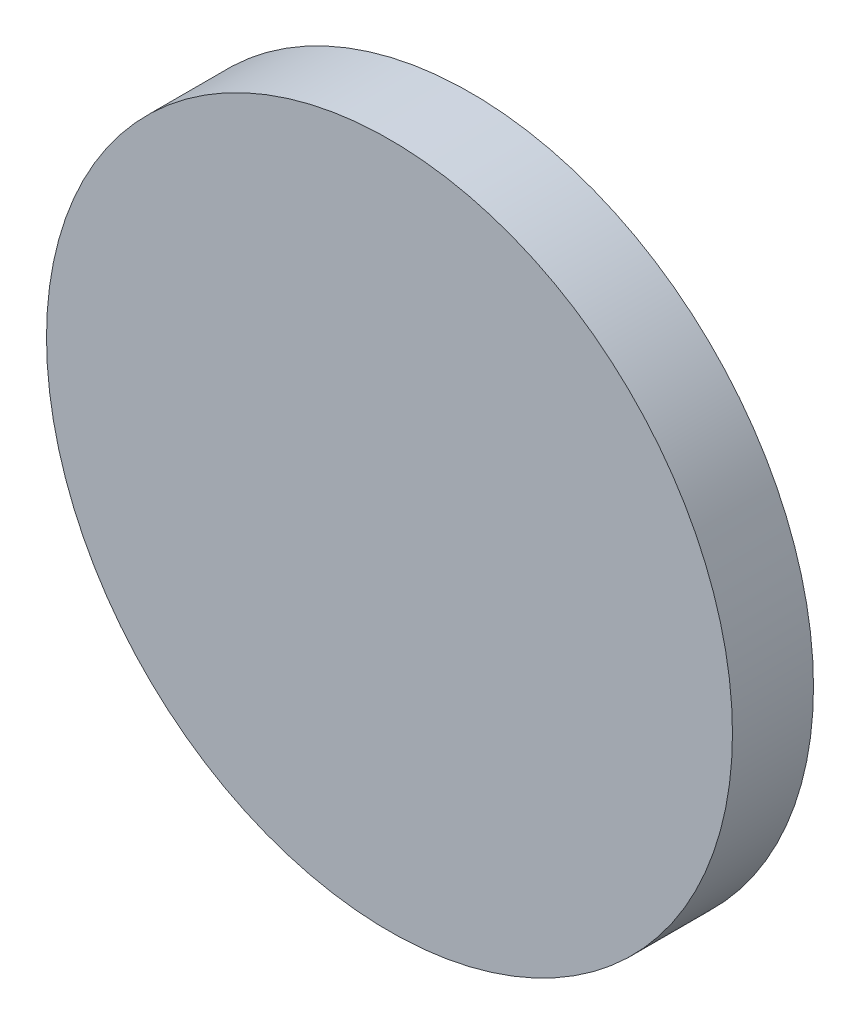
ISO-10303-21;
HEADER;
FILE_DESCRIPTION(('STEP AP214'),'2;1');
FILE_NAME('part.step','',(''),(''),'','','');
FILE_SCHEMA(('AUTOMOTIVE_DESIGN { 1 0 10303 214 1 1 1 1 }'));
ENDSEC;
DATA;
#1=APPLICATION_CONTEXT('core data for automotive mechanical design processes');
#2=APPLICATION_PROTOCOL_DEFINITION('international standard','automotive_design',2000,#1);
#3=PRODUCT_CONTEXT('',#1,'mechanical');
#4=PRODUCT('Part','Part','',(#3));
#5=PRODUCT_RELATED_PRODUCT_CATEGORY('part','',(#4));
#6=PRODUCT_DEFINITION_FORMATION('','',#4);
#7=PRODUCT_DEFINITION_CONTEXT('part definition',#1,'design');
#8=PRODUCT_DEFINITION('design','',#6,#7);
#9=PRODUCT_DEFINITION_SHAPE('','',#8);
#10=(LENGTH_UNIT() NAMED_UNIT(*) SI_UNIT(.MILLI.,.METRE.));
#11=(NAMED_UNIT(*) PLANE_ANGLE_UNIT() SI_UNIT($,.RADIAN.));
#12=(NAMED_UNIT(*) SI_UNIT($,.STERADIAN.) SOLID_ANGLE_UNIT());
#13=UNCERTAINTY_MEASURE_WITH_UNIT(LENGTH_MEASURE(1.E-05),#10,'distance_accuracy_value','');
#14=(GEOMETRIC_REPRESENTATION_CONTEXT(3) GLOBAL_UNCERTAINTY_ASSIGNED_CONTEXT((#13)) GLOBAL_UNIT_ASSIGNED_CONTEXT((#10,
#11,#12)) REPRESENTATION_CONTEXT('',''));
#15=CARTESIAN_POINT('',(0.,0.,0.));
#16=DIRECTION('',(0.,0.,1.));
#17=DIRECTION('',(1.,0.,0.));
#18=AXIS2_PLACEMENT_3D('',#15,#16,#17);
#19=CARTESIAN_POINT('',(0.,0.,3.));
#20=DIRECTION('',(0.,0.,-1.));
#21=DIRECTION('',(-1.,0.,0.));
#22=AXIS2_PLACEMENT_3D('',#19,#20,#21);
#23=CYLINDRICAL_SURFACE('',#22,12.7);
#24=CARTESIAN_POINT('',(0.,0.,3.));
#25=DIRECTION('',(0.,0.,1.));
#26=DIRECTION('',(1.,0.,0.));
#27=AXIS2_PLACEMENT_3D('',#24,#25,#26);
#28=CIRCLE('',#27,12.7);
#29=CARTESIAN_POINT('',(12.7,0.,3.));
#30=VERTEX_POINT('',#29);
#31=EDGE_CURVE('E10',#30,#30,#28,.T.);
#32=ORIENTED_EDGE('',*,*,#31,.F.);
#33=EDGE_LOOP('',(#32));
#34=FACE_BOUND('',#33,.T.);
#35=CARTESIAN_POINT('',(0.,0.,0.));
#36=DIRECTION('',(0.,0.,1.));
#37=DIRECTION('',(1.,0.,0.));
#38=AXIS2_PLACEMENT_3D('',#35,#36,#37);
#39=CIRCLE('',#38,12.7);
#40=CARTESIAN_POINT('',(12.7,0.,0.));
#41=VERTEX_POINT('',#40);
#42=EDGE_CURVE('E38',#41,#41,#39,.T.);
#43=ORIENTED_EDGE('',*,*,#42,.T.);
#44=EDGE_LOOP('',(#43));
#45=FACE_BOUND('',#44,.T.);
#46=ADVANCED_FACE('F35',(#34,#45),#23,.T.);
#47=CARTESIAN_POINT('',(0.,0.,3.));
#48=DIRECTION('',(0.,0.,1.));
#49=DIRECTION('',(1.,0.,0.));
#50=AXIS2_PLACEMENT_3D('',#47,#48,#49);
#51=PLANE('',#50);
#52=ORIENTED_EDGE('',*,*,#31,.T.);
#53=EDGE_LOOP('',(#52));
#54=FACE_BOUND('',#53,.T.);
#55=ADVANCED_FACE('F50',(#54),#51,.T.);
#56=CARTESIAN_POINT('',(0.,0.,0.));
#57=DIRECTION('',(0.,0.,1.));
#58=DIRECTION('',(1.,0.,0.));
#59=AXIS2_PLACEMENT_3D('',#56,#57,#58);
#60=PLANE('',#59);
#61=ORIENTED_EDGE('',*,*,#42,.F.);
#62=EDGE_LOOP('',(#61));
#63=FACE_BOUND('',#62,.T.);
#64=ADVANCED_FACE('F48',(#63),#60,.F.);
#65=CLOSED_SHELL('',(#46,#55,#64));
#66=MANIFOLD_SOLID_BREP('B2',#65);
#67=ADVANCED_BREP_SHAPE_REPRESENTATION('',(#18,#66),#14);
#68=SHAPE_DEFINITION_REPRESENTATION(#9,#67);
ENDSEC;
END-ISO-10303-21;
